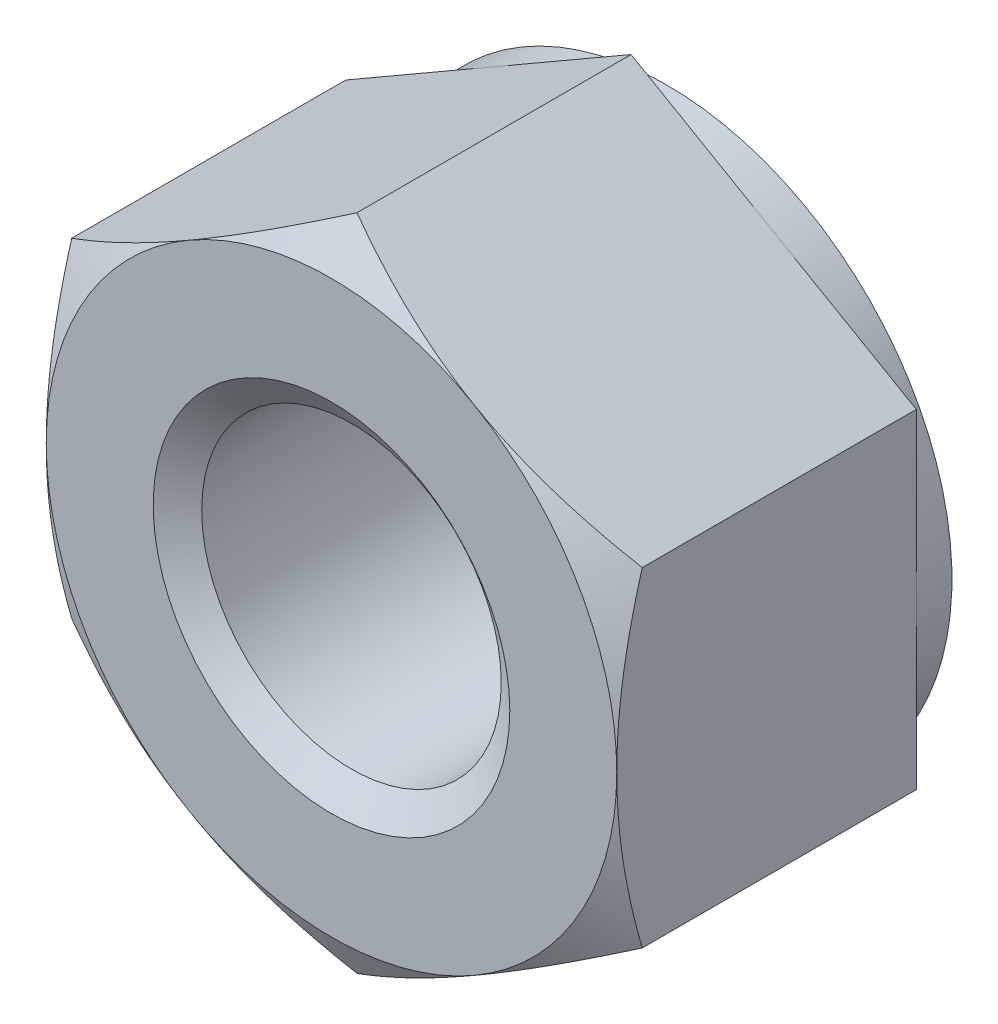
ISO-10303-21;
HEADER;
FILE_DESCRIPTION(('STEP AP214'),'2;1');
FILE_NAME('part.step','',(''),(''),'','','');
FILE_SCHEMA(('AUTOMOTIVE_DESIGN { 1 0 10303 214 1 1 1 1 }'));
ENDSEC;
DATA;
#1=APPLICATION_CONTEXT('core data for automotive mechanical design processes');
#2=APPLICATION_PROTOCOL_DEFINITION('international standard','automotive_design',2000,#1);
#3=PRODUCT_CONTEXT('',#1,'mechanical');
#4=PRODUCT('Part','Part','',(#3));
#5=PRODUCT_RELATED_PRODUCT_CATEGORY('part','',(#4));
#6=PRODUCT_DEFINITION_FORMATION('','',#4);
#7=PRODUCT_DEFINITION_CONTEXT('part definition',#1,'design');
#8=PRODUCT_DEFINITION('design','',#6,#7);
#9=PRODUCT_DEFINITION_SHAPE('','',#8);
#10=(LENGTH_UNIT() NAMED_UNIT(*) SI_UNIT(.MILLI.,.METRE.));
#11=(NAMED_UNIT(*) PLANE_ANGLE_UNIT() SI_UNIT($,.RADIAN.));
#12=(NAMED_UNIT(*) SI_UNIT($,.STERADIAN.) SOLID_ANGLE_UNIT());
#13=UNCERTAINTY_MEASURE_WITH_UNIT(LENGTH_MEASURE(1.E-05),#10,'distance_accuracy_value','');
#14=(GEOMETRIC_REPRESENTATION_CONTEXT(3) GLOBAL_UNCERTAINTY_ASSIGNED_CONTEXT((#13)) GLOBAL_UNIT_ASSIGNED_CONTEXT((#10,
#11,#12)) REPRESENTATION_CONTEXT('',''));
#15=CARTESIAN_POINT('',(0.,0.,0.));
#16=DIRECTION('',(0.,0.,1.));
#17=DIRECTION('',(1.,0.,0.));
#18=AXIS2_PLACEMENT_3D('',#15,#16,#17);
#19=CARTESIAN_POINT('',(0.,0.,-4.7));
#20=DIRECTION('',(0.,0.,1.));
#21=DIRECTION('',(1.,0.,0.));
#22=AXIS2_PLACEMENT_3D('',#19,#20,#21);
#23=CYLINDRICAL_SURFACE('',#22,2.1);
#24=CARTESIAN_POINT('',(0.,0.,-0.280083015283886));
#25=DIRECTION('',(0.,0.,1.));
#26=DIRECTION('',(1.,0.,0.));
#27=AXIS2_PLACEMENT_3D('',#24,#25,#26);
#28=CIRCLE('',#27,2.1);
#29=CARTESIAN_POINT('',(2.1,0.,-0.280083015283886));
#30=VERTEX_POINT('',#29);
#31=EDGE_CURVE('E155',#30,#30,#28,.F.);
#32=ORIENTED_EDGE('',*,*,#31,.F.);
#33=EDGE_LOOP('',(#32));
#34=FACE_BOUND('',#33,.T.);
#35=CARTESIAN_POINT('',(0.,0.,-4.39451698471612));
#36=DIRECTION('',(0.,0.,-1.));
#37=DIRECTION('',(-1.,0.,0.));
#38=AXIS2_PLACEMENT_3D('',#35,#36,#37);
#39=CIRCLE('',#38,2.1);
#40=CARTESIAN_POINT('',(-2.1,0.,-4.39451698471612));
#41=VERTEX_POINT('',#40);
#42=EDGE_CURVE('E43',#41,#41,#39,.F.);
#43=ORIENTED_EDGE('',*,*,#42,.F.);
#44=EDGE_LOOP('',(#43));
#45=FACE_BOUND('',#44,.T.);
#46=ADVANCED_FACE('F38',(#34,#45),#23,.F.);
#47=CARTESIAN_POINT('',(0.,4.61880215351701,-4.7));
#48=DIRECTION('',(-0.5,0.866025403784439,0.));
#49=DIRECTION('',(-0.866025403784439,-0.5,0.));
#50=AXIS2_PLACEMENT_3D('',#47,#48,#49);
#51=PLANE('',#50);
#52=DIRECTION('',(0.,0.,1.));
#53=VECTOR('',#52,1.);
#54=CARTESIAN_POINT('',(-4.,2.3094010767585,-4.7));
#55=LINE('',#54,#53);
#56=CARTESIAN_POINT('',(-4.,2.3094010767585,-4.2));
#57=VERTEX_POINT('',#56);
#58=CARTESIAN_POINT('',(-4.,2.3094010767585,-0.357265589908166));
#59=VERTEX_POINT('',#58);
#60=EDGE_CURVE('E290',#57,#59,#55,.T.);
#61=ORIENTED_EDGE('',*,*,#60,.T.);
#62=CARTESIAN_POINT('',(-4.0002,2.30928560670467,-0.357332259074769));
#63=CARTESIAN_POINT('',(-3.82442084967677,2.41077174646171,-0.298717873648284));
#64=CARTESIAN_POINT('',(-3.64712438367362,2.513133908835,-0.245410321462264));
#65=CARTESIAN_POINT('',(-3.28946140682429,2.71963072479812,-0.152361670746404));
#66=CARTESIAN_POINT('',(-3.10908854102985,2.82376904741904,-0.112653489029704));
#67=CARTESIAN_POINT('',(-2.75057818129721,3.03075510011795,-0.050842215280279));
#68=CARTESIAN_POINT('',(-2.57249584706486,3.13357098372492,-0.0283277315228887));
#69=CARTESIAN_POINT('',(-2.21549328283349,3.33968651028528,-0.0014506231465818));
#70=CARTESIAN_POINT('',(-2.0365743503559,3.44298540411434,0.00293425857305664));
#71=CARTESIAN_POINT('',(-1.70225715780327,3.63600352522932,-0.00619007293997052));
#72=CARTESIAN_POINT('',(-1.54680884001293,3.72575165335065,-0.0174589539879945));
#73=CARTESIAN_POINT('',(-1.23692494436494,3.90466320392055,-0.0531739907981937));
#74=CARTESIAN_POINT('',(-1.08249043825587,3.99382600759479,-0.0776323457115339));
#75=CARTESIAN_POINT('',(-0.77196767222542,4.17310641015197,-0.138776064919291));
#76=CARTESIAN_POINT('',(-0.615918711936896,4.26320131938131,-0.175720603654865));
#77=CARTESIAN_POINT('',(-0.30614816459616,4.44204742827551,-0.259570072548029));
#78=CARTESIAN_POINT('',(-0.15242260922622,4.53080091904966,-0.306455302212743));
#79=CARTESIAN_POINT('',(0.000200000000001207,4.61891762357085,-0.35733225907477));
#80=B_SPLINE_CURVE_WITH_KNOTS('',3,(#62,#63,#64,#65,#66,#67,#68,#69,#70,#71,#72,#73,#74,#75,#76,
#77,#78,#79),.UNSPECIFIED.,.F.,.F.,(4,2,2,2,2,2,2,2,4),(0.,0.634047835695967,1.26961969224543,
1.88946157213122,2.50854226669297,3.04757825393386,3.58711366126904,4.13861653143764,
4.68903648037743),.UNSPECIFIED.);
#81=CARTESIAN_POINT('',(-2.,3.46410161513775,0.));
#82=VERTEX_POINT('',#81);
#83=EDGE_CURVE('E62',#59,#82,#80,.T.);
#84=ORIENTED_EDGE('',*,*,#83,.T.);
#85=CARTESIAN_POINT('',(0.,4.61880215351701,-0.357265589908166));
#86=VERTEX_POINT('',#85);
#87=EDGE_CURVE('E169',#82,#86,#80,.T.);
#88=ORIENTED_EDGE('',*,*,#87,.T.);
#89=DIRECTION('',(0.,0.,1.));
#90=VECTOR('',#89,1.);
#91=CARTESIAN_POINT('',(0.,4.61880215351701,-4.7));
#92=LINE('',#91,#90);
#93=CARTESIAN_POINT('',(0.,4.61880215351701,-4.2));
#94=VERTEX_POINT('',#93);
#95=EDGE_CURVE('E278',#94,#86,#92,.T.);
#96=ORIENTED_EDGE('',*,*,#95,.F.);
#97=DIRECTION('',(-0.866025403784439,-0.5,0.));
#98=VECTOR('',#97,1.);
#99=CARTESIAN_POINT('',(0.,4.61880215351701,-4.2));
#100=LINE('',#99,#98);
#101=CARTESIAN_POINT('',(-2.,3.46410161513776,-4.2));
#102=VERTEX_POINT('',#101);
#103=EDGE_CURVE('E266',#94,#102,#100,.T.);
#104=ORIENTED_EDGE('',*,*,#103,.T.);
#105=EDGE_CURVE('E262',#102,#57,#100,.T.);
#106=ORIENTED_EDGE('',*,*,#105,.T.);
#107=EDGE_LOOP('',(#61,#84,#88,#96,#104,#106));
#108=FACE_BOUND('',#107,.T.);
#109=ADVANCED_FACE('F40',(#108),#51,.T.);
#110=CARTESIAN_POINT('',(4.,2.3094010767585,-4.7));
#111=DIRECTION('',(0.500000000000001,0.866025403784438,0.));
#112=DIRECTION('',(-0.866025403784438,0.500000000000001,0.));
#113=AXIS2_PLACEMENT_3D('',#110,#111,#112);
#114=PLANE('',#113);
#115=ORIENTED_EDGE('',*,*,#95,.T.);
#116=CARTESIAN_POINT('',(-0.000199999999999266,4.61891762357085,-0.35733225907477));
#117=CARTESIAN_POINT('',(0.175579150323229,4.51743148381381,-0.298717873648285));
#118=CARTESIAN_POINT('',(0.352875616326382,4.41506932144052,-0.245410321462265));
#119=CARTESIAN_POINT('',(0.710538593175708,4.2085725054774,-0.152361670746405));
#120=CARTESIAN_POINT('',(0.890911458970152,4.10443418285647,-0.112653489029705));
#121=CARTESIAN_POINT('',(1.24942181870279,3.89744813015756,-0.0508422152802789));
#122=CARTESIAN_POINT('',(1.42750415293514,3.79463224655059,-0.0283277315228885));
#123=CARTESIAN_POINT('',(1.78450671716651,3.58851671999023,-0.00145062314658148));
#124=CARTESIAN_POINT('',(1.9634256496441,3.48521782616117,0.00293425857305701));
#125=CARTESIAN_POINT('',(2.29774284219673,3.29219970504619,-0.00619007293997002));
#126=CARTESIAN_POINT('',(2.45319115998707,3.20245157692486,-0.0174589539879939));
#127=CARTESIAN_POINT('',(2.76307505563506,3.02354002635496,-0.0531739907981927));
#128=CARTESIAN_POINT('',(2.91750956174413,2.93437722268072,-0.0776323457115327));
#129=CARTESIAN_POINT('',(3.22803232777458,2.75509682012354,-0.138776064919289));
#130=CARTESIAN_POINT('',(3.3840812880631,2.6650019108942,-0.175720603654864));
#131=CARTESIAN_POINT('',(3.69385183540384,2.486155802,-0.259570072548028));
#132=CARTESIAN_POINT('',(3.84757739077378,2.39740231122584,-0.306455302212741));
#133=CARTESIAN_POINT('',(4.0002,2.30928560670466,-0.357332259074768));
#134=B_SPLINE_CURVE_WITH_KNOTS('',3,(#116,#117,#118,#119,#120,#121,#122,#123,#124,#125,#126,
#127,#128,#129,#130,#131,#132,#133),.UNSPECIFIED.,.F.,.F.,(4,2,2,2,2,2,2,2,4),(0.,
0.634047835695968,1.26961969224544,1.88946157213122,2.50854226669297,3.04757825393386,
3.58711366126904,4.13861653143764,4.68903648037743),.UNSPECIFIED.);
#135=CARTESIAN_POINT('',(2.,3.46410161513775,0.));
#136=VERTEX_POINT('',#135);
#137=EDGE_CURVE('E166',#86,#136,#134,.T.);
#138=ORIENTED_EDGE('',*,*,#137,.T.);
#139=CARTESIAN_POINT('',(4.,2.30940107675851,-0.357265589908166));
#140=VERTEX_POINT('',#139);
#141=EDGE_CURVE('E149',#136,#140,#134,.T.);
#142=ORIENTED_EDGE('',*,*,#141,.T.);
#143=DIRECTION('',(0.,0.,1.));
#144=VECTOR('',#143,1.);
#145=CARTESIAN_POINT('',(4.,2.3094010767585,-4.7));
#146=LINE('',#145,#144);
#147=CARTESIAN_POINT('',(4.,2.3094010767585,-4.2));
#148=VERTEX_POINT('',#147);
#149=EDGE_CURVE('E165',#148,#140,#146,.T.);
#150=ORIENTED_EDGE('',*,*,#149,.F.);
#151=DIRECTION('',(-0.866025403784438,0.500000000000001,0.));
#152=VECTOR('',#151,1.);
#153=CARTESIAN_POINT('',(4.,2.3094010767585,-4.2));
#154=LINE('',#153,#152);
#155=CARTESIAN_POINT('',(2.,3.46410161513775,-4.2));
#156=VERTEX_POINT('',#155);
#157=EDGE_CURVE('E274',#148,#156,#154,.T.);
#158=ORIENTED_EDGE('',*,*,#157,.T.);
#159=EDGE_CURVE('E270',#156,#94,#154,.T.);
#160=ORIENTED_EDGE('',*,*,#159,.T.);
#161=EDGE_LOOP('',(#115,#138,#142,#150,#158,#160));
#162=FACE_BOUND('',#161,.T.);
#163=ADVANCED_FACE('F238',(#162),#114,.T.);
#164=CARTESIAN_POINT('',(4.,2.3094010767585,-4.7));
#165=DIRECTION('',(-1.,0.,0.));
#166=DIRECTION('',(0.,0.,1.));
#167=AXIS2_PLACEMENT_3D('',#164,#165,#166);
#168=PLANE('',#167);
#169=CARTESIAN_POINT('',(4.,-6.12487198995892,-1.91410682124064));
#170=CARTESIAN_POINT('',(4.,-5.94924937038676,-1.8292362707669));
#171=CARTESIAN_POINT('',(4.,-5.77321152095286,-1.7452094038074));
#172=CARTESIAN_POINT('',(4.,-5.42008084777954,-1.57932514679716));
#173=CARTESIAN_POINT('',(4.,-5.24298784779928,-1.49746813236723));
#174=CARTESIAN_POINT('',(4.,-4.88656571686334,-1.33597446305856));
#175=CARTESIAN_POINT('',(4.,-4.70722958889362,-1.25635319506304));
#176=CARTESIAN_POINT('',(4.,-4.34708334747263,-1.1005305854203));
#177=CARTESIAN_POINT('',(4.,-4.16627331143537,-1.02432906550802));
#178=CARTESIAN_POINT('',(4.,-3.80064706744978,-0.875350650394363));
#179=CARTESIAN_POINT('',(4.,-3.6158089282277,-0.802627284215846));
#180=CARTESIAN_POINT('',(4.,-3.24395246794968,-0.66287623095942));
#181=CARTESIAN_POINT('',(4.,-3.05693390695801,-0.595849177566505));
#182=CARTESIAN_POINT('',(4.,-2.68080318253771,-0.469291748430882));
#183=CARTESIAN_POINT('',(4.,-2.49169643712849,-0.409745434783838));
#184=CARTESIAN_POINT('',(4.,-2.11079454635851,-0.300083356544507));
#185=CARTESIAN_POINT('',(4.,-1.91900027185749,-0.249964609676752));
#186=CARTESIAN_POINT('',(4.,-1.532592326982,-0.161590794954042));
#187=CARTESIAN_POINT('',(4.,-1.3379779203165,-0.12333888595654));
#188=CARTESIAN_POINT('',(4.,-0.946402725872553,-0.0612742359223431));
#189=CARTESIAN_POINT('',(4.,-0.749441936019772,-0.0374615076516987));
#190=CARTESIAN_POINT('',(4.,-0.355451989627941,-0.00638181314943627));
#191=CARTESIAN_POINT('',(4.,-0.15843131109401,0.000989900761041356));
#192=CARTESIAN_POINT('',(4.,0.23547208560747,-0.00120406637479588));
#193=CARTESIAN_POINT('',(4.,0.432354826312206,-0.0107653508153513));
#194=CARTESIAN_POINT('',(4.,0.768560635225518,-0.0408787346135914));
#195=CARTESIAN_POINT('',(4.,0.90825461838182,-0.0575092960439104));
#196=CARTESIAN_POINT('',(4.,1.18656349063497,-0.0982134103466923));
#197=CARTESIAN_POINT('',(4.,1.32517820601013,-0.122288137058447));
#198=CARTESIAN_POINT('',(4.,1.73929045452969,-0.204415070950231));
#199=CARTESIAN_POINT('',(4.,2.01284690528722,-0.272348886425154));
#200=CARTESIAN_POINT('',(4.,2.42218253014524,-0.389516359317204));
#201=CARTESIAN_POINT('',(4.,2.56009536361539,-0.431713941811637));
#202=CARTESIAN_POINT('',(4.,2.83448159101404,-0.520284580227763));
#203=CARTESIAN_POINT('',(4.,2.97095590623557,-0.566654756186913));
#204=CARTESIAN_POINT('',(4.,3.24189440516341,-0.662605699180288));
#205=CARTESIAN_POINT('',(4.,3.37636557946838,-0.712166925753501));
#206=CARTESIAN_POINT('',(4.,3.64426461152914,-0.814198353790703));
#207=CARTESIAN_POINT('',(4.,3.77769202239387,-0.866669730963371));
#208=CARTESIAN_POINT('',(4.,3.91063698986684,-0.920309006541794));
#209=B_SPLINE_CURVE_WITH_KNOTS('',3,(#169,#170,#171,#172,#173,#174,#175,#176,#177,#178,#179,
#180,#181,#182,#183,#184,#185,#186,#187,#188,#189,#190,#191,#192,#193,#194,#195,#196,#197,#198,
#199,#200,#201,#202,#203,#204,#205,#206,#207,#208),.UNSPECIFIED.,.F.,.F.,(4,2,2,2,2,2,2,2,2,2,2,
2,2,2,2,2,2,2,2,4),(0.,0.585171792532271,1.17044423059927,1.7590659464599,2.34765694284827,
2.94347400997483,3.53935727210689,4.13394864697601,4.72835161391471,5.32291267067845,
5.91747425310813,6.50823685854037,7.09884609659886,7.52068140825521,7.9425832713084,
8.7870149135983,9.21965281897689,9.65199437116297,10.0819024146297,10.5119854255247),.UNSPECIFIED.);
#210=CARTESIAN_POINT('',(4.,-2.30940107675851,-0.357265589908166));
#211=VERTEX_POINT('',#210);
#212=CARTESIAN_POINT('',(4.,0.,0.));
#213=VERTEX_POINT('',#212);
#214=EDGE_CURVE('E130',#211,#213,#209,.T.);
#215=ORIENTED_EDGE('',*,*,#214,.F.);
#216=DIRECTION('',(0.,0.,1.));
#217=VECTOR('',#216,1.);
#218=CARTESIAN_POINT('',(4.,-2.30940107675851,-4.7));
#219=LINE('',#218,#217);
#220=CARTESIAN_POINT('',(4.,-2.30940107675851,-4.2));
#221=VERTEX_POINT('',#220);
#222=EDGE_CURVE('E283',#221,#211,#219,.T.);
#223=ORIENTED_EDGE('',*,*,#222,.F.);
#224=DIRECTION('',(0.,-1.,0.));
#225=VECTOR('',#224,1.);
#226=CARTESIAN_POINT('',(4.,2.3094010767585,-4.2));
#227=LINE('',#226,#225);
#228=CARTESIAN_POINT('',(4.,0.,-4.2));
#229=VERTEX_POINT('',#228);
#230=EDGE_CURVE('E275',#229,#221,#227,.T.);
#231=ORIENTED_EDGE('',*,*,#230,.F.);
#232=EDGE_CURVE('E277',#148,#229,#227,.T.);
#233=ORIENTED_EDGE('',*,*,#232,.F.);
#234=ORIENTED_EDGE('',*,*,#149,.T.);
#235=EDGE_CURVE('E143',#213,#140,#209,.T.);
#236=ORIENTED_EDGE('',*,*,#235,.F.);
#237=EDGE_LOOP('',(#215,#223,#231,#233,#234,#236));
#238=FACE_BOUND('',#237,.T.);
#239=ADVANCED_FACE('F162',(#238),#168,.F.);
#240=CARTESIAN_POINT('',(0.,-4.61880215351701,-4.7));
#241=DIRECTION('',(0.5,-0.866025403784439,0.));
#242=DIRECTION('',(0.866025403784439,0.5,0.));
#243=AXIS2_PLACEMENT_3D('',#240,#241,#242);
#244=PLANE('',#243);
#245=ORIENTED_EDGE('',*,*,#222,.T.);
#246=CARTESIAN_POINT('',(4.0002,-2.30928560670467,-0.357332259074769));
#247=CARTESIAN_POINT('',(3.82442084967677,-2.41077174646171,-0.298717873648285));
#248=CARTESIAN_POINT('',(3.64712438367362,-2.513133908835,-0.245410321462265));
#249=CARTESIAN_POINT('',(3.28946140682429,-2.71963072479812,-0.152361670746405));
#250=CARTESIAN_POINT('',(3.10908854102985,-2.82376904741905,-0.112653489029705));
#251=CARTESIAN_POINT('',(2.75057818129721,-3.03075510011796,-0.0508422152802801));
#252=CARTESIAN_POINT('',(2.57249584706486,-3.13357098372492,-0.0283277315228903));
#253=CARTESIAN_POINT('',(2.21549328283349,-3.33968651028529,-0.00145062314658328));
#254=CARTESIAN_POINT('',(2.0365743503559,-3.44298540411435,0.00293425857305562));
#255=CARTESIAN_POINT('',(1.70225715780327,-3.63600352522933,-0.00619007293997174));
#256=CARTESIAN_POINT('',(1.54680884001293,-3.72575165335065,-0.0174589539879962));
#257=CARTESIAN_POINT('',(1.23692494436494,-3.90466320392055,-0.0531739907981954));
#258=CARTESIAN_POINT('',(1.08249043825587,-3.99382600759479,-0.0776323457115352));
#259=CARTESIAN_POINT('',(0.77196767222542,-4.17310641015198,-0.138776064919292));
#260=CARTESIAN_POINT('',(0.615918711936896,-4.26320131938132,-0.175720603654866));
#261=CARTESIAN_POINT('',(0.30614816459616,-4.44204742827551,-0.259570072548031));
#262=CARTESIAN_POINT('',(0.15242260922622,-4.53080091904967,-0.306455302212744));
#263=CARTESIAN_POINT('',(-0.000200000000000678,-4.61891762357085,-0.357332259074771));
#264=B_SPLINE_CURVE_WITH_KNOTS('',3,(#246,#247,#248,#249,#250,#251,#252,#253,#254,#255,#256,
#257,#258,#259,#260,#261,#262,#263),.UNSPECIFIED.,.F.,.F.,(4,2,2,2,2,2,2,2,4),(0.,
0.634047835695967,1.26961969224544,1.88946157213122,2.50854226669297,3.04757825393386,
3.58711366126904,4.13861653143764,4.68903648037743),.UNSPECIFIED.);
#265=CARTESIAN_POINT('',(2.,-3.46410161513775,0.));
#266=VERTEX_POINT('',#265);
#267=EDGE_CURVE('E137',#211,#266,#264,.T.);
#268=ORIENTED_EDGE('',*,*,#267,.T.);
#269=CARTESIAN_POINT('',(0.,-4.61880215351701,-0.357265589908166));
#270=VERTEX_POINT('',#269);
#271=EDGE_CURVE('E176',#266,#270,#264,.T.);
#272=ORIENTED_EDGE('',*,*,#271,.T.);
#273=DIRECTION('',(0.,0.,1.));
#274=VECTOR('',#273,1.);
#275=CARTESIAN_POINT('',(0.,-4.61880215351701,-4.7));
#276=LINE('',#275,#274);
#277=CARTESIAN_POINT('',(0.,-4.61880215351701,-4.2));
#278=VERTEX_POINT('',#277);
#279=EDGE_CURVE('E285',#278,#270,#276,.T.);
#280=ORIENTED_EDGE('',*,*,#279,.F.);
#281=DIRECTION('',(0.866025403784439,0.5,0.));
#282=VECTOR('',#281,1.);
#283=CARTESIAN_POINT('',(0.,-4.61880215351701,-4.2));
#284=LINE('',#283,#282);
#285=CARTESIAN_POINT('',(2.,-3.46410161513776,-4.2));
#286=VERTEX_POINT('',#285);
#287=EDGE_CURVE('E267',#278,#286,#284,.T.);
#288=ORIENTED_EDGE('',*,*,#287,.T.);
#289=EDGE_CURVE('E271',#286,#221,#284,.T.);
#290=ORIENTED_EDGE('',*,*,#289,.T.);
#291=EDGE_LOOP('',(#245,#268,#272,#280,#288,#290));
#292=FACE_BOUND('',#291,.T.);
#293=ADVANCED_FACE('F219',(#292),#244,.T.);
#294=CARTESIAN_POINT('',(-4.,-2.3094010767585,-4.7));
#295=DIRECTION('',(-0.500000000000001,-0.866025403784438,0.));
#296=DIRECTION('',(0.866025403784438,-0.500000000000001,0.));
#297=AXIS2_PLACEMENT_3D('',#294,#295,#296);
#298=PLANE('',#297);
#299=ORIENTED_EDGE('',*,*,#279,.T.);
#300=CARTESIAN_POINT('',(0.000199999999999499,-4.61891762357085,-0.357332259074771));
#301=CARTESIAN_POINT('',(-0.175579150323229,-4.51743148381381,-0.298717873648287));
#302=CARTESIAN_POINT('',(-0.352875616326382,-4.41506932144052,-0.245410321462267));
#303=CARTESIAN_POINT('',(-0.710538593175708,-4.2085725054774,-0.152361670746406));
#304=CARTESIAN_POINT('',(-0.890911458970153,-4.10443418285647,-0.112653489029706));
#305=CARTESIAN_POINT('',(-1.24942181870279,-3.89744813015756,-0.0508422152802804));
#306=CARTESIAN_POINT('',(-1.42750415293515,-3.7946322465506,-0.0283277315228903));
#307=CARTESIAN_POINT('',(-1.78450671716651,-3.58851671999023,-0.0014506231465832));
#308=CARTESIAN_POINT('',(-1.9634256496441,-3.48521782616117,0.0029342585730556));
#309=CARTESIAN_POINT('',(-2.29774284219674,-3.29219970504619,-0.00619007293997137));
#310=CARTESIAN_POINT('',(-2.45319115998707,-3.20245157692486,-0.0174589539879954));
#311=CARTESIAN_POINT('',(-2.76307505563506,-3.02354002635497,-0.0531739907981946));
#312=CARTESIAN_POINT('',(-2.91750956174413,-2.93437722268073,-0.0776323457115347));
#313=CARTESIAN_POINT('',(-3.22803232777458,-2.75509682012354,-0.138776064919291));
#314=CARTESIAN_POINT('',(-3.3840812880631,-2.6650019108942,-0.175720603654865));
#315=CARTESIAN_POINT('',(-3.69385183540384,-2.48615580200001,-0.259570072548029));
#316=CARTESIAN_POINT('',(-3.84757739077378,-2.39740231122585,-0.306455302212742));
#317=CARTESIAN_POINT('',(-4.0002,-2.30928560670467,-0.357332259074769));
#318=B_SPLINE_CURVE_WITH_KNOTS('',3,(#300,#301,#302,#303,#304,#305,#306,#307,#308,#309,#310,
#311,#312,#313,#314,#315,#316,#317),.UNSPECIFIED.,.F.,.F.,(4,2,2,2,2,2,2,2,4),(0.,
0.634047835695967,1.26961969224544,1.88946157213122,2.50854226669298,3.04757825393386,
3.58711366126904,4.13861653143764,4.68903648037743),.UNSPECIFIED.);
#319=CARTESIAN_POINT('',(-2.,-3.46410161513775,0.));
#320=VERTEX_POINT('',#319);
#321=EDGE_CURVE('E213',#270,#320,#318,.T.);
#322=ORIENTED_EDGE('',*,*,#321,.T.);
#323=CARTESIAN_POINT('',(-4.,-2.30940107675851,-0.357265589908166));
#324=VERTEX_POINT('',#323);
#325=EDGE_CURVE('E206',#320,#324,#318,.T.);
#326=ORIENTED_EDGE('',*,*,#325,.T.);
#327=DIRECTION('',(0.,0.,1.));
#328=VECTOR('',#327,1.);
#329=CARTESIAN_POINT('',(-4.,-2.3094010767585,-4.7));
#330=LINE('',#329,#328);
#331=CARTESIAN_POINT('',(-4.,-2.3094010767585,-4.2));
#332=VERTEX_POINT('',#331);
#333=EDGE_CURVE('E288',#332,#324,#330,.T.);
#334=ORIENTED_EDGE('',*,*,#333,.F.);
#335=DIRECTION('',(0.866025403784438,-0.500000000000001,0.));
#336=VECTOR('',#335,1.);
#337=CARTESIAN_POINT('',(-4.,-2.3094010767585,-4.2));
#338=LINE('',#337,#336);
#339=CARTESIAN_POINT('',(-2.,-3.46410161513776,-4.2));
#340=VERTEX_POINT('',#339);
#341=EDGE_CURVE('E257',#332,#340,#338,.T.);
#342=ORIENTED_EDGE('',*,*,#341,.T.);
#343=EDGE_CURVE('E263',#340,#278,#338,.T.);
#344=ORIENTED_EDGE('',*,*,#343,.T.);
#345=EDGE_LOOP('',(#299,#322,#326,#334,#342,#344));
#346=FACE_BOUND('',#345,.T.);
#347=ADVANCED_FACE('F215',(#346),#298,.T.);
#348=CARTESIAN_POINT('',(-4.,2.3094010767585,-4.7));
#349=DIRECTION('',(-1.,0.,0.));
#350=DIRECTION('',(0.,0.,1.));
#351=AXIS2_PLACEMENT_3D('',#348,#349,#350);
#352=PLANE('',#351);
#353=ORIENTED_EDGE('',*,*,#333,.T.);
#354=CARTESIAN_POINT('',(-4.,-6.12487198995892,-1.91410682124064));
#355=CARTESIAN_POINT('',(-4.,-5.94924937038676,-1.8292362707669));
#356=CARTESIAN_POINT('',(-4.,-5.77321152095286,-1.7452094038074));
#357=CARTESIAN_POINT('',(-4.,-5.42008084777954,-1.57932514679716));
#358=CARTESIAN_POINT('',(-4.,-5.24298784779927,-1.49746813236723));
#359=CARTESIAN_POINT('',(-4.,-4.88656571686333,-1.33597446305856));
#360=CARTESIAN_POINT('',(-4.,-4.70722958889362,-1.25635319506304));
#361=CARTESIAN_POINT('',(-4.,-4.34708334747263,-1.1005305854203));
#362=CARTESIAN_POINT('',(-4.,-4.16627331143537,-1.02432906550802));
#363=CARTESIAN_POINT('',(-4.,-3.80064706744977,-0.875350650394362));
#364=CARTESIAN_POINT('',(-4.,-3.61580892822769,-0.802627284215845));
#365=CARTESIAN_POINT('',(-4.,-3.24395246794968,-0.662876230959419));
#366=CARTESIAN_POINT('',(-4.,-3.05693390695801,-0.595849177566504));
#367=CARTESIAN_POINT('',(-4.,-2.6808031825377,-0.469291748430881));
#368=CARTESIAN_POINT('',(-4.,-2.49169643712848,-0.409745434783837));
#369=CARTESIAN_POINT('',(-4.,-2.11079454635851,-0.300083356544506));
#370=CARTESIAN_POINT('',(-4.,-1.91900027185748,-0.249964609676751));
#371=CARTESIAN_POINT('',(-4.,-1.532592326982,-0.161590794954041));
#372=CARTESIAN_POINT('',(-4.,-1.33797792031649,-0.12333888595654));
#373=CARTESIAN_POINT('',(-4.,-0.946402725872551,-0.0612742359223432));
#374=CARTESIAN_POINT('',(-4.,-0.749441936019771,-0.0374615076516988));
#375=CARTESIAN_POINT('',(-4.,-0.35545198962794,-0.00638181314943621));
#376=CARTESIAN_POINT('',(-4.,-0.158431311094009,0.000989900761041378));
#377=CARTESIAN_POINT('',(-4.,0.235472085607471,-0.00120406637479591));
#378=CARTESIAN_POINT('',(-4.,0.432354826312207,-0.0107653508153513));
#379=CARTESIAN_POINT('',(-4.,0.768560635225519,-0.0408787346135914));
#380=CARTESIAN_POINT('',(-4.,0.908254618381822,-0.0575092960439104));
#381=CARTESIAN_POINT('',(-4.,1.18656349063498,-0.0982134103466924));
#382=CARTESIAN_POINT('',(-4.,1.32517820601014,-0.122288137058447));
#383=CARTESIAN_POINT('',(-4.,1.7392904545297,-0.204415070950232));
#384=CARTESIAN_POINT('',(-4.,2.01284690528723,-0.272348886425155));
#385=CARTESIAN_POINT('',(-4.,2.42218253014524,-0.389516359317206));
#386=CARTESIAN_POINT('',(-4.,2.56009536361539,-0.431713941811639));
#387=CARTESIAN_POINT('',(-4.,2.83448159101404,-0.520284580227765));
#388=CARTESIAN_POINT('',(-4.,2.97095590623558,-0.566654756186915));
#389=CARTESIAN_POINT('',(-4.,3.24189440516341,-0.662605699180289));
#390=CARTESIAN_POINT('',(-4.,3.37636557946838,-0.712166925753503));
#391=CARTESIAN_POINT('',(-4.,3.64426461152914,-0.814198353790705));
#392=CARTESIAN_POINT('',(-4.,3.77769202239387,-0.866669730963372));
#393=CARTESIAN_POINT('',(-4.,3.91063698986685,-0.920309006541795));
#394=B_SPLINE_CURVE_WITH_KNOTS('',3,(#354,#355,#356,#357,#358,#359,#360,#361,#362,#363,#364,
#365,#366,#367,#368,#369,#370,#371,#372,#373,#374,#375,#376,#377,#378,#379,#380,#381,#382,#383,
#384,#385,#386,#387,#388,#389,#390,#391,#392,#393),.UNSPECIFIED.,.F.,.F.,(4,2,2,2,2,2,2,2,2,2,2,
2,2,2,2,2,2,2,2,4),(0.,0.585171792532272,1.17044423059927,1.7590659464599,2.34765694284827,
2.94347400997483,3.53935727210689,4.133948646976,4.72835161391471,5.32291267067845,
5.91747425310813,6.50823685854036,7.09884609659886,7.52068140825521,7.9425832713084,
8.7870149135983,9.21965281897689,9.65199437116297,10.0819024146297,10.5119854255247),.UNSPECIFIED.);
#395=CARTESIAN_POINT('',(-4.,0.,0.));
#396=VERTEX_POINT('',#395);
#397=EDGE_CURVE('E214',#324,#396,#394,.T.);
#398=ORIENTED_EDGE('',*,*,#397,.T.);
#399=EDGE_CURVE('E154',#396,#59,#394,.T.);
#400=ORIENTED_EDGE('',*,*,#399,.T.);
#401=ORIENTED_EDGE('',*,*,#60,.F.);
#402=DIRECTION('',(0.,-1.,0.));
#403=VECTOR('',#402,1.);
#404=CARTESIAN_POINT('',(-4.,2.3094010767585,-4.2));
#405=LINE('',#404,#403);
#406=CARTESIAN_POINT('',(-4.,0.,-4.2));
#407=VERTEX_POINT('',#406);
#408=EDGE_CURVE('E297',#57,#407,#405,.T.);
#409=ORIENTED_EDGE('',*,*,#408,.T.);
#410=EDGE_CURVE('E295',#407,#332,#405,.T.);
#411=ORIENTED_EDGE('',*,*,#410,.T.);
#412=EDGE_LOOP('',(#353,#398,#400,#401,#409,#411));
#413=FACE_BOUND('',#412,.T.);
#414=ADVANCED_FACE('F218',(#413),#352,.T.);
#415=CARTESIAN_POINT('',(0.,4.61880215351701,0.));
#416=DIRECTION('',(0.,0.,-1.));
#417=DIRECTION('',(-1.,0.,0.));
#418=AXIS2_PLACEMENT_3D('',#415,#416,#417);
#419=PLANE('',#418);
#420=CARTESIAN_POINT('',(0.,0.,0.));
#421=DIRECTION('',(0.,0.,1.));
#422=DIRECTION('',(1.,0.,0.));
#423=AXIS2_PLACEMENT_3D('',#420,#421,#422);
#424=CIRCLE('',#423,2.5);
#425=CARTESIAN_POINT('',(2.5,0.,0.));
#426=VERTEX_POINT('',#425);
#427=EDGE_CURVE('E300',#426,#426,#424,.T.);
#428=ORIENTED_EDGE('',*,*,#427,.F.);
#429=EDGE_LOOP('',(#428));
#430=FACE_BOUND('',#429,.T.);
#431=CARTESIAN_POINT('',(0.,0.,0.));
#432=DIRECTION('',(0.,0.,-1.));
#433=DIRECTION('',(-1.,0.,0.));
#434=AXIS2_PLACEMENT_3D('',#431,#432,#433);
#435=CIRCLE('',#434,4.);
#436=EDGE_CURVE('E50',#82,#396,#435,.F.);
#437=ORIENTED_EDGE('',*,*,#436,.T.);
#438=EDGE_CURVE('E12',#396,#320,#435,.F.);
#439=ORIENTED_EDGE('',*,*,#438,.T.);
#440=EDGE_CURVE('E48',#320,#266,#435,.F.);
#441=ORIENTED_EDGE('',*,*,#440,.T.);
#442=EDGE_CURVE('E134',#266,#213,#435,.F.);
#443=ORIENTED_EDGE('',*,*,#442,.T.);
#444=CARTESIAN_POINT('',(0.,0.,0.));
#445=DIRECTION('',(0.,0.,1.));
#446=DIRECTION('',(1.,0.,0.));
#447=AXIS2_PLACEMENT_3D('',#444,#445,#446);
#448=CIRCLE('',#447,4.);
#449=EDGE_CURVE('E146',#213,#136,#448,.T.);
#450=ORIENTED_EDGE('',*,*,#449,.T.);
#451=EDGE_CURVE('E160',#136,#82,#435,.F.);
#452=ORIENTED_EDGE('',*,*,#451,.T.);
#453=EDGE_LOOP('',(#437,#439,#441,#443,#450,#452));
#454=FACE_BOUND('',#453,.T.);
#455=ADVANCED_FACE('F158',(#430,#454),#419,.F.);
#456=CARTESIAN_POINT('',(0.,4.61880215351701,-4.7));
#457=DIRECTION('',(0.,0.,-1.));
#458=DIRECTION('',(-1.,0.,0.));
#459=AXIS2_PLACEMENT_3D('',#456,#457,#458);
#460=PLANE('',#459);
#461=CARTESIAN_POINT('',(0.,0.,-4.7));
#462=DIRECTION('',(0.,0.,-1.));
#463=DIRECTION('',(-1.,0.,0.));
#464=AXIS2_PLACEMENT_3D('',#461,#462,#463);
#465=CIRCLE('',#464,2.5);
#466=CARTESIAN_POINT('',(-2.5,0.,-4.7));
#467=VERTEX_POINT('',#466);
#468=EDGE_CURVE('E301',#467,#467,#465,.F.);
#469=ORIENTED_EDGE('',*,*,#468,.T.);
#470=EDGE_LOOP('',(#469));
#471=FACE_BOUND('',#470,.T.);
#472=CARTESIAN_POINT('',(0.,0.,-4.7));
#473=DIRECTION('',(0.,0.,-1.));
#474=DIRECTION('',(-1.,0.,0.));
#475=AXIS2_PLACEMENT_3D('',#472,#473,#474);
#476=CIRCLE('',#475,4.);
#477=CARTESIAN_POINT('',(-4.,0.,-4.7));
#478=VERTEX_POINT('',#477);
#479=EDGE_CURVE('E281',#478,#478,#476,.F.);
#480=ORIENTED_EDGE('',*,*,#479,.F.);
#481=EDGE_LOOP('',(#480));
#482=FACE_BOUND('',#481,.T.);
#483=ADVANCED_FACE('F228',(#471,#482),#460,.T.);
#484=CARTESIAN_POINT('',(0.,14.618802153517,-4.2));
#485=DIRECTION('',(0.,0.,-1.));
#486=DIRECTION('',(-1.,0.,0.));
#487=AXIS2_PLACEMENT_3D('',#484,#485,#486);
#488=PLANE('',#487);
#489=ORIENTED_EDGE('',*,*,#232,.T.);
#490=CARTESIAN_POINT('',(0.,0.,-4.2));
#491=DIRECTION('',(0.,0.,1.));
#492=DIRECTION('',(1.,0.,0.));
#493=AXIS2_PLACEMENT_3D('',#490,#491,#492);
#494=CIRCLE('',#493,4.);
#495=EDGE_CURVE('E254',#229,#156,#494,.T.);
#496=ORIENTED_EDGE('',*,*,#495,.T.);
#497=ORIENTED_EDGE('',*,*,#157,.F.);
#498=EDGE_LOOP('',(#489,#496,#497));
#499=FACE_BOUND('',#498,.T.);
#500=ADVANCED_FACE('F245',(#499),#488,.T.);
#501=ORIENTED_EDGE('',*,*,#230,.T.);
#502=ORIENTED_EDGE('',*,*,#289,.F.);
#503=EDGE_CURVE('E259',#286,#229,#494,.T.);
#504=ORIENTED_EDGE('',*,*,#503,.T.);
#505=EDGE_LOOP('',(#501,#502,#504));
#506=FACE_BOUND('',#505,.T.);
#507=ADVANCED_FACE('F447',(#506),#488,.T.);
#508=EDGE_CURVE('E258',#156,#102,#494,.T.);
#509=ORIENTED_EDGE('',*,*,#508,.T.);
#510=ORIENTED_EDGE('',*,*,#103,.F.);
#511=ORIENTED_EDGE('',*,*,#159,.F.);
#512=EDGE_LOOP('',(#509,#510,#511));
#513=FACE_BOUND('',#512,.T.);
#514=ADVANCED_FACE('F438',(#513),#488,.T.);
#515=ORIENTED_EDGE('',*,*,#343,.F.);
#516=EDGE_CURVE('E511',#340,#286,#494,.T.);
#517=ORIENTED_EDGE('',*,*,#516,.T.);
#518=ORIENTED_EDGE('',*,*,#287,.F.);
#519=EDGE_LOOP('',(#515,#517,#518));
#520=FACE_BOUND('',#519,.T.);
#521=ADVANCED_FACE('F429',(#520),#488,.T.);
#522=EDGE_CURVE('E525',#102,#407,#494,.T.);
#523=ORIENTED_EDGE('',*,*,#522,.T.);
#524=ORIENTED_EDGE('',*,*,#408,.F.);
#525=ORIENTED_EDGE('',*,*,#105,.F.);
#526=EDGE_LOOP('',(#523,#524,#525));
#527=FACE_BOUND('',#526,.T.);
#528=ADVANCED_FACE('F413',(#527),#488,.T.);
#529=CARTESIAN_POINT('',(0.,0.,0.));
#530=DIRECTION('',(0.,0.,1.));
#531=DIRECTION('',(1.,0.,0.));
#532=AXIS2_PLACEMENT_3D('',#529,#530,#531);
#533=CYLINDRICAL_SURFACE('',#532,4.);
#534=ORIENTED_EDGE('',*,*,#479,.T.);
#535=EDGE_LOOP('',(#534));
#536=FACE_BOUND('',#535,.T.);
#537=ORIENTED_EDGE('',*,*,#508,.F.);
#538=ORIENTED_EDGE('',*,*,#495,.F.);
#539=ORIENTED_EDGE('',*,*,#503,.F.);
#540=ORIENTED_EDGE('',*,*,#516,.F.);
#541=EDGE_CURVE('E527',#407,#340,#494,.T.);
#542=ORIENTED_EDGE('',*,*,#541,.F.);
#543=ORIENTED_EDGE('',*,*,#522,.F.);
#544=EDGE_LOOP('',(#537,#538,#539,#540,#542,#543));
#545=FACE_BOUND('',#544,.T.);
#546=ADVANCED_FACE('F243',(#536,#545),#533,.T.);
#547=ORIENTED_EDGE('',*,*,#410,.F.);
#548=ORIENTED_EDGE('',*,*,#541,.T.);
#549=ORIENTED_EDGE('',*,*,#341,.F.);
#550=EDGE_LOOP('',(#547,#548,#549));
#551=FACE_BOUND('',#550,.T.);
#552=ADVANCED_FACE('F196',(#551),#488,.T.);
#553=CARTESIAN_POINT('',(0.,0.,0.));
#554=DIRECTION('',(0.,0.,-1.));
#555=DIRECTION('',(-1.,0.,0.));
#556=AXIS2_PLACEMENT_3D('',#553,#554,#555);
#557=CONICAL_SURFACE('',#556,4.,1.0471975511966);
#558=ORIENTED_EDGE('',*,*,#399,.F.);
#559=ORIENTED_EDGE('',*,*,#436,.F.);
#560=ORIENTED_EDGE('',*,*,#83,.F.);
#561=EDGE_LOOP('',(#558,#559,#560));
#562=FACE_BOUND('',#561,.T.);
#563=ADVANCED_FACE('F375',(#562),#557,.T.);
#564=ORIENTED_EDGE('',*,*,#451,.F.);
#565=ORIENTED_EDGE('',*,*,#137,.F.);
#566=ORIENTED_EDGE('',*,*,#87,.F.);
#567=EDGE_LOOP('',(#564,#565,#566));
#568=FACE_BOUND('',#567,.T.);
#569=ADVANCED_FACE('F194',(#568),#557,.T.);
#570=ORIENTED_EDGE('',*,*,#449,.F.);
#571=ORIENTED_EDGE('',*,*,#235,.T.);
#572=ORIENTED_EDGE('',*,*,#141,.F.);
#573=EDGE_LOOP('',(#570,#571,#572));
#574=FACE_BOUND('',#573,.T.);
#575=ADVANCED_FACE('F147',(#574),#557,.T.);
#576=ORIENTED_EDGE('',*,*,#214,.T.);
#577=ORIENTED_EDGE('',*,*,#442,.F.);
#578=ORIENTED_EDGE('',*,*,#267,.F.);
#579=EDGE_LOOP('',(#576,#577,#578));
#580=FACE_BOUND('',#579,.T.);
#581=ADVANCED_FACE('F132',(#580),#557,.T.);
#582=ORIENTED_EDGE('',*,*,#440,.F.);
#583=ORIENTED_EDGE('',*,*,#321,.F.);
#584=ORIENTED_EDGE('',*,*,#271,.F.);
#585=EDGE_LOOP('',(#582,#583,#584));
#586=FACE_BOUND('',#585,.T.);
#587=ADVANCED_FACE('F193',(#586),#557,.T.);
#588=ORIENTED_EDGE('',*,*,#438,.F.);
#589=ORIENTED_EDGE('',*,*,#397,.F.);
#590=ORIENTED_EDGE('',*,*,#325,.F.);
#591=EDGE_LOOP('',(#588,#589,#590));
#592=FACE_BOUND('',#591,.T.);
#593=ADVANCED_FACE('F187',(#592),#557,.T.);
#594=CARTESIAN_POINT('',(0.,0.,-0.308091316812274));
#595=DIRECTION('',(0.,0.,1.));
#596=DIRECTION('',(1.,0.,0.));
#597=AXIS2_PLACEMENT_3D('',#594,#595,#596);
#598=CONICAL_SURFACE('',#597,2.06,0.959931088596879);
#599=ORIENTED_EDGE('',*,*,#427,.T.);
#600=EDGE_LOOP('',(#599));
#601=FACE_BOUND('',#600,.T.);
#602=ORIENTED_EDGE('',*,*,#31,.T.);
#603=EDGE_LOOP('',(#602));
#604=FACE_BOUND('',#603,.T.);
#605=ADVANCED_FACE('F192',(#601,#604),#598,.F.);
#606=CARTESIAN_POINT('',(0.,0.,-4.6746));
#607=DIRECTION('',(0.,0.,-1.));
#608=DIRECTION('',(-1.,0.,0.));
#609=AXIS2_PLACEMENT_3D('',#606,#607,#608);
#610=CONICAL_SURFACE('',#609,2.5,0.959931088596884);
#611=CARTESIAN_POINT('',(0.,0.,-4.6746));
#612=DIRECTION('',(0.,0.,1.));
#613=DIRECTION('',(1.,0.,0.));
#614=AXIS2_PLACEMENT_3D('',#611,#612,#613);
#615=CIRCLE('',#614,2.5);
#616=CARTESIAN_POINT('',(2.5,0.,-4.6746));
#617=VERTEX_POINT('',#616);
#618=EDGE_CURVE('E303',#617,#617,#615,.T.);
#619=ORIENTED_EDGE('',*,*,#618,.F.);
#620=EDGE_LOOP('',(#619));
#621=FACE_BOUND('',#620,.T.);
#622=ORIENTED_EDGE('',*,*,#42,.T.);
#623=EDGE_LOOP('',(#622));
#624=FACE_BOUND('',#623,.T.);
#625=ADVANCED_FACE('F316',(#621,#624),#610,.F.);
#626=CARTESIAN_POINT('',(0.,0.,-25.0375057290932));
#627=DIRECTION('',(0.,0.,1.));
#628=DIRECTION('',(1.,0.,0.));
#629=AXIS2_PLACEMENT_3D('',#626,#627,#628);
#630=CYLINDRICAL_SURFACE('',#629,2.5);
#631=ORIENTED_EDGE('',*,*,#468,.F.);
#632=EDGE_LOOP('',(#631));
#633=FACE_BOUND('',#632,.T.);
#634=ORIENTED_EDGE('',*,*,#618,.T.);
#635=EDGE_LOOP('',(#634));
#636=FACE_BOUND('',#635,.T.);
#637=ADVANCED_FACE('F320',(#633,#636),#630,.F.);
#638=CLOSED_SHELL('',(#46,#109,#163,#239,#293,#347,#414,#455,#483,#500,#507,#514,#521,#528,#546,
#552,#563,#569,#575,#581,#587,#593,#605,#625,#637));
#639=MANIFOLD_SOLID_BREP('B2',#638);
#640=ADVANCED_BREP_SHAPE_REPRESENTATION('',(#18,#639),#14);
#641=SHAPE_DEFINITION_REPRESENTATION(#9,#640);
ENDSEC;
END-ISO-10303-21;
